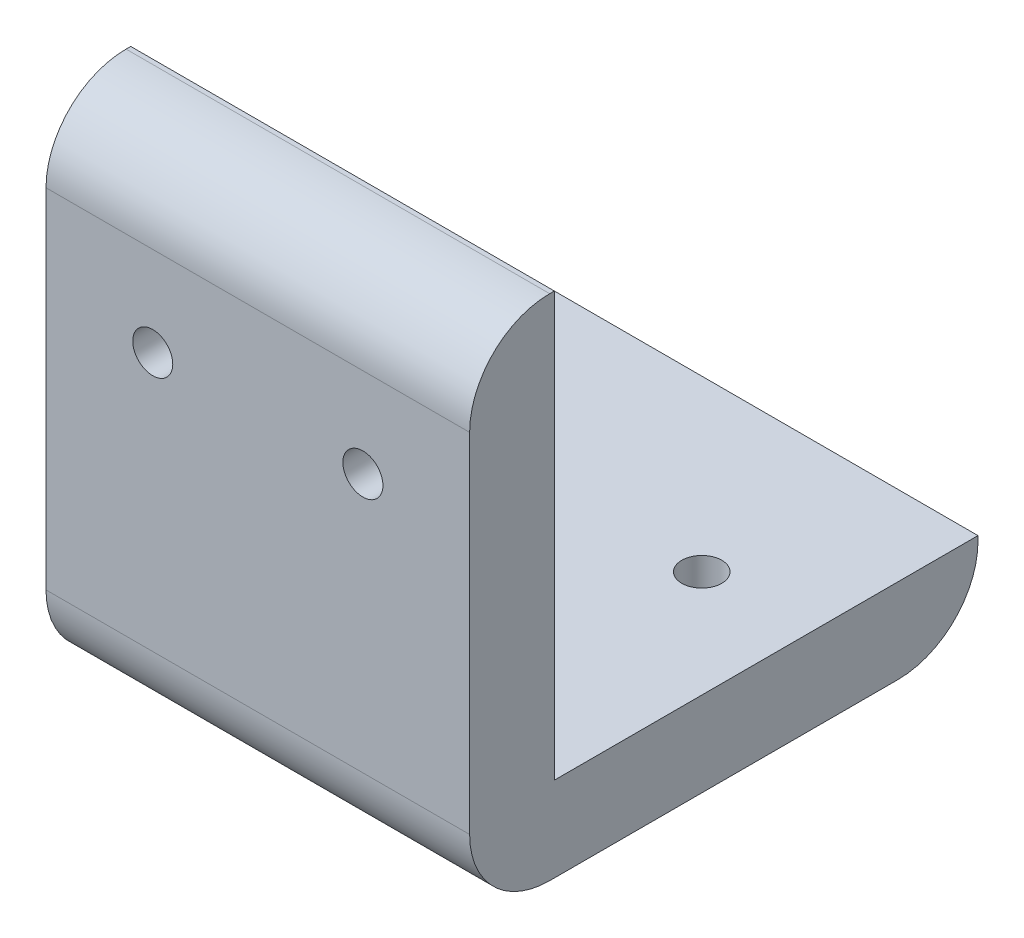
ISO-10303-21;
HEADER;
FILE_DESCRIPTION(('STEP AP214'),'2;1');
FILE_NAME('part.step','',(''),(''),'','','');
FILE_SCHEMA(('AUTOMOTIVE_DESIGN { 1 0 10303 214 1 1 1 1 }'));
ENDSEC;
DATA;
#1=APPLICATION_CONTEXT('core data for automotive mechanical design processes');
#2=APPLICATION_PROTOCOL_DEFINITION('international standard','automotive_design',2000,#1);
#3=PRODUCT_CONTEXT('',#1,'mechanical');
#4=PRODUCT('Part','Part','',(#3));
#5=PRODUCT_RELATED_PRODUCT_CATEGORY('part','',(#4));
#6=PRODUCT_DEFINITION_FORMATION('','',#4);
#7=PRODUCT_DEFINITION_CONTEXT('part definition',#1,'design');
#8=PRODUCT_DEFINITION('design','',#6,#7);
#9=PRODUCT_DEFINITION_SHAPE('','',#8);
#10=(LENGTH_UNIT() NAMED_UNIT(*) SI_UNIT(.MILLI.,.METRE.));
#11=(NAMED_UNIT(*) PLANE_ANGLE_UNIT() SI_UNIT($,.RADIAN.));
#12=(NAMED_UNIT(*) SI_UNIT($,.STERADIAN.) SOLID_ANGLE_UNIT());
#13=UNCERTAINTY_MEASURE_WITH_UNIT(LENGTH_MEASURE(1.E-05),#10,'distance_accuracy_value','');
#14=(GEOMETRIC_REPRESENTATION_CONTEXT(3) GLOBAL_UNCERTAINTY_ASSIGNED_CONTEXT((#13)) GLOBAL_UNIT_ASSIGNED_CONTEXT((#10,
#11,#12)) REPRESENTATION_CONTEXT('',''));
#15=CARTESIAN_POINT('',(0.,0.,0.));
#16=DIRECTION('',(0.,0.,1.));
#17=DIRECTION('',(1.,0.,0.));
#18=AXIS2_PLACEMENT_3D('',#15,#16,#17);
#19=CARTESIAN_POINT('',(31.75,31.75,0.));
#20=DIRECTION('',(0.,-1.,0.));
#21=DIRECTION('',(0.,0.,-1.));
#22=AXIS2_PLACEMENT_3D('',#19,#20,#21);
#23=PLANE('',#22);
#24=DIRECTION('',(0.,0.,1.));
#25=VECTOR('',#24,1.);
#26=CARTESIAN_POINT('',(0.,31.75,0.));
#27=LINE('',#26,#25);
#28=CARTESIAN_POINT('',(0.,31.75,0.));
#29=VERTEX_POINT('',#28);
#30=CARTESIAN_POINT('',(0.,31.75,0.349999999999997));
#31=VERTEX_POINT('',#30);
#32=EDGE_CURVE('E139',#29,#31,#27,.T.);
#33=ORIENTED_EDGE('',*,*,#32,.T.);
#34=DIRECTION('',(-1.,0.,0.));
#35=VECTOR('',#34,1.);
#36=CARTESIAN_POINT('',(31.75,31.75,0.349999999999997));
#37=LINE('',#36,#35);
#38=CARTESIAN_POINT('',(31.75,31.75,0.349999999999997));
#39=VERTEX_POINT('',#38);
#40=EDGE_CURVE('E163',#31,#39,#37,.F.);
#41=ORIENTED_EDGE('',*,*,#40,.T.);
#42=DIRECTION('',(0.,0.,1.));
#43=VECTOR('',#42,1.);
#44=CARTESIAN_POINT('',(31.75,31.75,0.));
#45=LINE('',#44,#43);
#46=CARTESIAN_POINT('',(31.75,31.75,0.));
#47=VERTEX_POINT('',#46);
#48=EDGE_CURVE('E152',#47,#39,#45,.T.);
#49=ORIENTED_EDGE('',*,*,#48,.F.);
#50=DIRECTION('',(-1.,0.,0.));
#51=VECTOR('',#50,1.);
#52=CARTESIAN_POINT('',(31.75,31.75,0.));
#53=LINE('',#52,#51);
#54=EDGE_CURVE('E135',#47,#29,#53,.T.);
#55=ORIENTED_EDGE('',*,*,#54,.T.);
#56=EDGE_LOOP('',(#33,#41,#49,#55));
#57=FACE_BOUND('',#56,.T.);
#58=ADVANCED_FACE('F37',(#57),#23,.F.);
#59=CARTESIAN_POINT('',(31.75,31.75,6.35));
#60=DIRECTION('',(0.,0.,-1.));
#61=DIRECTION('',(0.,1.,0.));
#62=AXIS2_PLACEMENT_3D('',#59,#60,#61);
#63=PLANE('',#62);
#64=CARTESIAN_POINT('',(8.,19.05,6.35));
#65=DIRECTION('',(0.,0.,1.));
#66=DIRECTION('',(1.,0.,0.));
#67=AXIS2_PLACEMENT_3D('',#64,#65,#66);
#68=CIRCLE('',#67,1.5);
#69=CARTESIAN_POINT('',(9.5,19.05,6.35));
#70=VERTEX_POINT('',#69);
#71=EDGE_CURVE('E177',#70,#70,#68,.T.);
#72=ORIENTED_EDGE('',*,*,#71,.F.);
#73=EDGE_LOOP('',(#72));
#74=FACE_BOUND('',#73,.T.);
#75=CARTESIAN_POINT('',(23.75,19.05,6.35));
#76=DIRECTION('',(0.,0.,1.));
#77=DIRECTION('',(1.,0.,0.));
#78=AXIS2_PLACEMENT_3D('',#75,#76,#77);
#79=CIRCLE('',#78,1.5);
#80=CARTESIAN_POINT('',(25.25,19.05,6.35));
#81=VERTEX_POINT('',#80);
#82=EDGE_CURVE('E187',#81,#81,#79,.T.);
#83=ORIENTED_EDGE('',*,*,#82,.F.);
#84=EDGE_LOOP('',(#83));
#85=FACE_BOUND('',#84,.T.);
#86=DIRECTION('',(0.,-1.,0.));
#87=VECTOR('',#86,1.);
#88=CARTESIAN_POINT('',(0.,31.75,6.35));
#89=LINE('',#88,#87);
#90=CARTESIAN_POINT('',(0.,25.75,6.35));
#91=VERTEX_POINT('',#90);
#92=CARTESIAN_POINT('',(0.,-0.350000000000003,6.35));
#93=VERTEX_POINT('',#92);
#94=EDGE_CURVE('E142',#91,#93,#89,.T.);
#95=ORIENTED_EDGE('',*,*,#94,.T.);
#96=DIRECTION('',(-1.,0.,0.));
#97=VECTOR('',#96,1.);
#98=CARTESIAN_POINT('',(31.75,-0.350000000000003,6.35));
#99=LINE('',#98,#97);
#100=CARTESIAN_POINT('',(31.75,-0.350000000000003,6.35));
#101=VERTEX_POINT('',#100);
#102=EDGE_CURVE('E45',#93,#101,#99,.F.);
#103=ORIENTED_EDGE('',*,*,#102,.T.);
#104=DIRECTION('',(0.,-1.,0.));
#105=VECTOR('',#104,1.);
#106=CARTESIAN_POINT('',(31.75,31.75,6.35));
#107=LINE('',#106,#105);
#108=CARTESIAN_POINT('',(31.75,25.75,6.35));
#109=VERTEX_POINT('',#108);
#110=EDGE_CURVE('E269',#109,#101,#107,.T.);
#111=ORIENTED_EDGE('',*,*,#110,.F.);
#112=DIRECTION('',(-1.,0.,0.));
#113=VECTOR('',#112,1.);
#114=CARTESIAN_POINT('',(31.75,25.75,6.35));
#115=LINE('',#114,#113);
#116=EDGE_CURVE('E127',#109,#91,#115,.T.);
#117=ORIENTED_EDGE('',*,*,#116,.T.);
#118=EDGE_LOOP('',(#95,#103,#111,#117));
#119=FACE_BOUND('',#118,.T.);
#120=ADVANCED_FACE('F213',(#74,#85,#119),#63,.F.);
#121=CARTESIAN_POINT('',(31.75,-6.35,6.34999999999999));
#122=DIRECTION('',(0.,1.,0.));
#123=DIRECTION('',(0.,0.,1.));
#124=AXIS2_PLACEMENT_3D('',#121,#122,#123);
#125=PLANE('',#124);
#126=CARTESIAN_POINT('',(8.,-6.35,-19.05));
#127=DIRECTION('',(0.,-1.,0.));
#128=DIRECTION('',(0.,0.,-1.));
#129=AXIS2_PLACEMENT_3D('',#126,#127,#128);
#130=CIRCLE('',#129,1.5);
#131=CARTESIAN_POINT('',(8.,-6.35,-20.55));
#132=VERTEX_POINT('',#131);
#133=EDGE_CURVE('E184',#132,#132,#130,.T.);
#134=ORIENTED_EDGE('',*,*,#133,.F.);
#135=EDGE_LOOP('',(#134));
#136=FACE_BOUND('',#135,.T.);
#137=CARTESIAN_POINT('',(23.75,-6.35,-19.05));
#138=DIRECTION('',(0.,-1.,0.));
#139=DIRECTION('',(0.,0.,-1.));
#140=AXIS2_PLACEMENT_3D('',#137,#138,#139);
#141=CIRCLE('',#140,1.5);
#142=CARTESIAN_POINT('',(23.75,-6.35,-20.55));
#143=VERTEX_POINT('',#142);
#144=EDGE_CURVE('E258',#143,#143,#141,.T.);
#145=ORIENTED_EDGE('',*,*,#144,.F.);
#146=EDGE_LOOP('',(#145));
#147=FACE_BOUND('',#146,.T.);
#148=DIRECTION('',(0.,0.,-1.));
#149=VECTOR('',#148,1.);
#150=CARTESIAN_POINT('',(31.75,-6.35,6.34999999999999));
#151=LINE('',#150,#149);
#152=CARTESIAN_POINT('',(31.75,-6.35,0.349999999999995));
#153=VERTEX_POINT('',#152);
#154=CARTESIAN_POINT('',(31.75,-6.35,-25.75));
#155=VERTEX_POINT('',#154);
#156=EDGE_CURVE('E118',#153,#155,#151,.T.);
#157=ORIENTED_EDGE('',*,*,#156,.F.);
#158=DIRECTION('',(-1.,0.,0.));
#159=VECTOR('',#158,1.);
#160=CARTESIAN_POINT('',(31.75,-6.35,0.349999999999995));
#161=LINE('',#160,#159);
#162=CARTESIAN_POINT('',(0.,-6.35,0.349999999999995));
#163=VERTEX_POINT('',#162);
#164=EDGE_CURVE('E173',#153,#163,#161,.T.);
#165=ORIENTED_EDGE('',*,*,#164,.T.);
#166=DIRECTION('',(0.,0.,-1.));
#167=VECTOR('',#166,1.);
#168=CARTESIAN_POINT('',(0.,-6.35,6.34999999999999));
#169=LINE('',#168,#167);
#170=CARTESIAN_POINT('',(0.,-6.35,-25.75));
#171=VERTEX_POINT('',#170);
#172=EDGE_CURVE('E145',#163,#171,#169,.T.);
#173=ORIENTED_EDGE('',*,*,#172,.T.);
#174=DIRECTION('',(-1.,0.,0.));
#175=VECTOR('',#174,1.);
#176=CARTESIAN_POINT('',(31.75,-6.35,-25.75));
#177=LINE('',#176,#175);
#178=EDGE_CURVE('E170',#171,#155,#177,.F.);
#179=ORIENTED_EDGE('',*,*,#178,.T.);
#180=EDGE_LOOP('',(#157,#165,#173,#179));
#181=FACE_BOUND('',#180,.T.);
#182=ADVANCED_FACE('F193',(#136,#147,#181),#125,.F.);
#183=CARTESIAN_POINT('',(31.75,-6.35,-31.75));
#184=DIRECTION('',(0.,0.,1.));
#185=DIRECTION('',(1.,0.,0.));
#186=AXIS2_PLACEMENT_3D('',#183,#184,#185);
#187=PLANE('',#186);
#188=DIRECTION('',(0.,1.,0.));
#189=VECTOR('',#188,1.);
#190=CARTESIAN_POINT('',(31.75,-6.35,-31.75));
#191=LINE('',#190,#189);
#192=CARTESIAN_POINT('',(31.75,-0.350000000000005,-31.75));
#193=VERTEX_POINT('',#192);
#194=CARTESIAN_POINT('',(31.75,0.,-31.75));
#195=VERTEX_POINT('',#194);
#196=EDGE_CURVE('E107',#193,#195,#191,.T.);
#197=ORIENTED_EDGE('',*,*,#196,.F.);
#198=DIRECTION('',(-1.,0.,0.));
#199=VECTOR('',#198,1.);
#200=CARTESIAN_POINT('',(31.75,-0.350000000000005,-31.75));
#201=LINE('',#200,#199);
#202=CARTESIAN_POINT('',(0.,-0.350000000000005,-31.75));
#203=VERTEX_POINT('',#202);
#204=EDGE_CURVE('E168',#193,#203,#201,.T.);
#205=ORIENTED_EDGE('',*,*,#204,.T.);
#206=DIRECTION('',(0.,1.,0.));
#207=VECTOR('',#206,1.);
#208=CARTESIAN_POINT('',(0.,-6.35,-31.75));
#209=LINE('',#208,#207);
#210=CARTESIAN_POINT('',(0.,0.,-31.75));
#211=VERTEX_POINT('',#210);
#212=EDGE_CURVE('E124',#203,#211,#209,.T.);
#213=ORIENTED_EDGE('',*,*,#212,.T.);
#214=DIRECTION('',(-1.,0.,0.));
#215=VECTOR('',#214,1.);
#216=CARTESIAN_POINT('',(31.75,0.,-31.75));
#217=LINE('',#216,#215);
#218=EDGE_CURVE('E121',#195,#211,#217,.T.);
#219=ORIENTED_EDGE('',*,*,#218,.F.);
#220=EDGE_LOOP('',(#197,#205,#213,#219));
#221=FACE_BOUND('',#220,.T.);
#222=ADVANCED_FACE('F122',(#221),#187,.F.);
#223=CARTESIAN_POINT('',(31.75,0.,-31.75));
#224=DIRECTION('',(0.,-1.,0.));
#225=DIRECTION('',(0.,0.,-1.));
#226=AXIS2_PLACEMENT_3D('',#223,#224,#225);
#227=PLANE('',#226);
#228=CARTESIAN_POINT('',(8.,0.,-19.05));
#229=DIRECTION('',(0.,-1.,0.));
#230=DIRECTION('',(0.,0.,-1.));
#231=AXIS2_PLACEMENT_3D('',#228,#229,#230);
#232=CIRCLE('',#231,1.5);
#233=CARTESIAN_POINT('',(8.,0.,-20.55));
#234=VERTEX_POINT('',#233);
#235=EDGE_CURVE('E183',#234,#234,#232,.T.);
#236=ORIENTED_EDGE('',*,*,#235,.T.);
#237=EDGE_LOOP('',(#236));
#238=FACE_BOUND('',#237,.T.);
#239=CARTESIAN_POINT('',(23.75,0.,-19.05));
#240=DIRECTION('',(0.,-1.,0.));
#241=DIRECTION('',(0.,0.,-1.));
#242=AXIS2_PLACEMENT_3D('',#239,#240,#241);
#243=CIRCLE('',#242,1.5);
#244=CARTESIAN_POINT('',(23.75,0.,-20.55));
#245=VERTEX_POINT('',#244);
#246=EDGE_CURVE('E180',#245,#245,#243,.T.);
#247=ORIENTED_EDGE('',*,*,#246,.T.);
#248=EDGE_LOOP('',(#247));
#249=FACE_BOUND('',#248,.T.);
#250=DIRECTION('',(0.,0.,1.));
#251=VECTOR('',#250,1.);
#252=CARTESIAN_POINT('',(0.,0.,-31.75));
#253=LINE('',#252,#251);
#254=CARTESIAN_POINT('',(0.,0.,0.));
#255=VERTEX_POINT('',#254);
#256=EDGE_CURVE('E148',#211,#255,#253,.T.);
#257=ORIENTED_EDGE('',*,*,#256,.T.);
#258=DIRECTION('',(-1.,0.,0.));
#259=VECTOR('',#258,1.);
#260=CARTESIAN_POINT('',(31.75,0.,0.));
#261=LINE('',#260,#259);
#262=CARTESIAN_POINT('',(31.75,0.,0.));
#263=VERTEX_POINT('',#262);
#264=EDGE_CURVE('E128',#263,#255,#261,.T.);
#265=ORIENTED_EDGE('',*,*,#264,.F.);
#266=DIRECTION('',(0.,0.,1.));
#267=VECTOR('',#266,1.);
#268=CARTESIAN_POINT('',(31.75,0.,-31.75));
#269=LINE('',#268,#267);
#270=EDGE_CURVE('E111',#195,#263,#269,.T.);
#271=ORIENTED_EDGE('',*,*,#270,.F.);
#272=ORIENTED_EDGE('',*,*,#218,.T.);
#273=EDGE_LOOP('',(#257,#265,#271,#272));
#274=FACE_BOUND('',#273,.T.);
#275=ADVANCED_FACE('F130',(#238,#249,#274),#227,.F.);
#276=CARTESIAN_POINT('',(31.75,0.,0.));
#277=DIRECTION('',(0.,0.,1.));
#278=DIRECTION('',(1.,0.,0.));
#279=AXIS2_PLACEMENT_3D('',#276,#277,#278);
#280=PLANE('',#279);
#281=CARTESIAN_POINT('',(8.,19.05,0.));
#282=DIRECTION('',(0.,0.,1.));
#283=DIRECTION('',(1.,0.,0.));
#284=AXIS2_PLACEMENT_3D('',#281,#282,#283);
#285=CIRCLE('',#284,1.5);
#286=CARTESIAN_POINT('',(9.5,19.05,0.));
#287=VERTEX_POINT('',#286);
#288=EDGE_CURVE('E143',#287,#287,#285,.T.);
#289=ORIENTED_EDGE('',*,*,#288,.T.);
#290=EDGE_LOOP('',(#289));
#291=FACE_BOUND('',#290,.T.);
#292=CARTESIAN_POINT('',(23.75,19.05,0.));
#293=DIRECTION('',(0.,0.,1.));
#294=DIRECTION('',(1.,0.,0.));
#295=AXIS2_PLACEMENT_3D('',#292,#293,#294);
#296=CIRCLE('',#295,1.5);
#297=CARTESIAN_POINT('',(25.25,19.05,0.));
#298=VERTEX_POINT('',#297);
#299=EDGE_CURVE('E174',#298,#298,#296,.T.);
#300=ORIENTED_EDGE('',*,*,#299,.T.);
#301=EDGE_LOOP('',(#300));
#302=FACE_BOUND('',#301,.T.);
#303=DIRECTION('',(0.,1.,0.));
#304=VECTOR('',#303,1.);
#305=CARTESIAN_POINT('',(0.,0.,0.));
#306=LINE('',#305,#304);
#307=EDGE_CURVE('E150',#255,#29,#306,.T.);
#308=ORIENTED_EDGE('',*,*,#307,.T.);
#309=ORIENTED_EDGE('',*,*,#54,.F.);
#310=DIRECTION('',(0.,1.,0.));
#311=VECTOR('',#310,1.);
#312=CARTESIAN_POINT('',(31.75,0.,0.));
#313=LINE('',#312,#311);
#314=EDGE_CURVE('E133',#263,#47,#313,.T.);
#315=ORIENTED_EDGE('',*,*,#314,.F.);
#316=ORIENTED_EDGE('',*,*,#264,.T.);
#317=EDGE_LOOP('',(#308,#309,#315,#316));
#318=FACE_BOUND('',#317,.T.);
#319=ADVANCED_FACE('F229',(#291,#302,#318),#280,.F.);
#320=CARTESIAN_POINT('',(31.75,0.,0.));
#321=DIRECTION('',(1.,0.,0.));
#322=DIRECTION('',(0.,0.,-1.));
#323=AXIS2_PLACEMENT_3D('',#320,#321,#322);
#324=PLANE('',#323);
#325=ORIENTED_EDGE('',*,*,#110,.T.);
#326=CARTESIAN_POINT('',(31.75,-0.350000000000005,0.349999999999995));
#327=DIRECTION('',(1.,0.,0.));
#328=DIRECTION('',(0.,0.,-1.));
#329=AXIS2_PLACEMENT_3D('',#326,#327,#328);
#330=CIRCLE('',#329,6.);
#331=EDGE_CURVE('E11',#101,#153,#330,.T.);
#332=ORIENTED_EDGE('',*,*,#331,.T.);
#333=ORIENTED_EDGE('',*,*,#156,.T.);
#334=CARTESIAN_POINT('',(31.75,-0.350000000000005,-25.75));
#335=DIRECTION('',(1.,0.,0.));
#336=DIRECTION('',(0.,0.,-1.));
#337=AXIS2_PLACEMENT_3D('',#334,#335,#336);
#338=CIRCLE('',#337,6.);
#339=EDGE_CURVE('E114',#155,#193,#338,.T.);
#340=ORIENTED_EDGE('',*,*,#339,.T.);
#341=ORIENTED_EDGE('',*,*,#196,.T.);
#342=ORIENTED_EDGE('',*,*,#270,.T.);
#343=ORIENTED_EDGE('',*,*,#314,.T.);
#344=ORIENTED_EDGE('',*,*,#48,.T.);
#345=CARTESIAN_POINT('',(31.75,25.75,0.349999999999997));
#346=DIRECTION('',(1.,0.,0.));
#347=DIRECTION('',(0.,0.,-1.));
#348=AXIS2_PLACEMENT_3D('',#345,#346,#347);
#349=CIRCLE('',#348,6.);
#350=EDGE_CURVE('E166',#39,#109,#349,.T.);
#351=ORIENTED_EDGE('',*,*,#350,.T.);
#352=EDGE_LOOP('',(#325,#332,#333,#340,#341,#342,#343,#344,#351));
#353=FACE_BOUND('',#352,.T.);
#354=ADVANCED_FACE('F109',(#353),#324,.T.);
#355=CARTESIAN_POINT('',(0.,0.,0.));
#356=DIRECTION('',(1.,0.,0.));
#357=DIRECTION('',(0.,0.,-1.));
#358=AXIS2_PLACEMENT_3D('',#355,#356,#357);
#359=PLANE('',#358);
#360=ORIENTED_EDGE('',*,*,#172,.F.);
#361=CARTESIAN_POINT('',(0.,-0.350000000000005,0.349999999999995));
#362=DIRECTION('',(1.,0.,0.));
#363=DIRECTION('',(0.,0.,-1.));
#364=AXIS2_PLACEMENT_3D('',#361,#362,#363);
#365=CIRCLE('',#364,6.);
#366=EDGE_CURVE('E59',#163,#93,#365,.F.);
#367=ORIENTED_EDGE('',*,*,#366,.T.);
#368=ORIENTED_EDGE('',*,*,#94,.F.);
#369=CARTESIAN_POINT('',(0.,25.75,0.349999999999997));
#370=DIRECTION('',(1.,0.,0.));
#371=DIRECTION('',(0.,0.,-1.));
#372=AXIS2_PLACEMENT_3D('',#369,#370,#371);
#373=CIRCLE('',#372,6.);
#374=EDGE_CURVE('E161',#91,#31,#373,.F.);
#375=ORIENTED_EDGE('',*,*,#374,.T.);
#376=ORIENTED_EDGE('',*,*,#32,.F.);
#377=ORIENTED_EDGE('',*,*,#307,.F.);
#378=ORIENTED_EDGE('',*,*,#256,.F.);
#379=ORIENTED_EDGE('',*,*,#212,.F.);
#380=CARTESIAN_POINT('',(0.,-0.350000000000005,-25.75));
#381=DIRECTION('',(1.,0.,0.));
#382=DIRECTION('',(0.,0.,-1.));
#383=AXIS2_PLACEMENT_3D('',#380,#381,#382);
#384=CIRCLE('',#383,6.);
#385=EDGE_CURVE('E158',#203,#171,#384,.F.);
#386=ORIENTED_EDGE('',*,*,#385,.T.);
#387=EDGE_LOOP('',(#360,#367,#368,#375,#376,#377,#378,#379,#386));
#388=FACE_BOUND('',#387,.T.);
#389=ADVANCED_FACE('F196',(#388),#359,.F.);
#390=CARTESIAN_POINT('',(31.75,25.75,0.349999999999997));
#391=DIRECTION('',(-1.,0.,0.));
#392=DIRECTION('',(0.,0.,1.));
#393=AXIS2_PLACEMENT_3D('',#390,#391,#392);
#394=CYLINDRICAL_SURFACE('',#393,6.);
#395=ORIENTED_EDGE('',*,*,#350,.F.);
#396=ORIENTED_EDGE('',*,*,#40,.F.);
#397=ORIENTED_EDGE('',*,*,#374,.F.);
#398=ORIENTED_EDGE('',*,*,#116,.F.);
#399=EDGE_LOOP('',(#395,#396,#397,#398));
#400=FACE_BOUND('',#399,.T.);
#401=ADVANCED_FACE('F202',(#400),#394,.T.);
#402=CARTESIAN_POINT('',(31.75,-0.350000000000005,-25.75));
#403=DIRECTION('',(-1.,0.,0.));
#404=DIRECTION('',(0.,0.,1.));
#405=AXIS2_PLACEMENT_3D('',#402,#403,#404);
#406=CYLINDRICAL_SURFACE('',#405,6.);
#407=ORIENTED_EDGE('',*,*,#339,.F.);
#408=ORIENTED_EDGE('',*,*,#178,.F.);
#409=ORIENTED_EDGE('',*,*,#385,.F.);
#410=ORIENTED_EDGE('',*,*,#204,.F.);
#411=EDGE_LOOP('',(#407,#408,#409,#410));
#412=FACE_BOUND('',#411,.T.);
#413=ADVANCED_FACE('F199',(#412),#406,.T.);
#414=CARTESIAN_POINT('',(23.75,19.05,-31.75));
#415=DIRECTION('',(0.,0.,1.));
#416=DIRECTION('',(1.,0.,0.));
#417=AXIS2_PLACEMENT_3D('',#414,#415,#416);
#418=CYLINDRICAL_SURFACE('',#417,1.5);
#419=ORIENTED_EDGE('',*,*,#82,.T.);
#420=EDGE_LOOP('',(#419));
#421=FACE_BOUND('',#420,.T.);
#422=ORIENTED_EDGE('',*,*,#299,.F.);
#423=EDGE_LOOP('',(#422));
#424=FACE_BOUND('',#423,.T.);
#425=ADVANCED_FACE('F201',(#421,#424),#418,.F.);
#426=CARTESIAN_POINT('',(8.,19.05,-31.75));
#427=DIRECTION('',(0.,0.,1.));
#428=DIRECTION('',(1.,0.,0.));
#429=AXIS2_PLACEMENT_3D('',#426,#427,#428);
#430=CYLINDRICAL_SURFACE('',#429,1.5);
#431=ORIENTED_EDGE('',*,*,#71,.T.);
#432=EDGE_LOOP('',(#431));
#433=FACE_BOUND('',#432,.T.);
#434=ORIENTED_EDGE('',*,*,#288,.F.);
#435=EDGE_LOOP('',(#434));
#436=FACE_BOUND('',#435,.T.);
#437=ADVANCED_FACE('F207',(#433,#436),#430,.F.);
#438=CARTESIAN_POINT('',(23.75,31.75,-19.05));
#439=DIRECTION('',(0.,-1.,0.));
#440=DIRECTION('',(0.,0.,-1.));
#441=AXIS2_PLACEMENT_3D('',#438,#439,#440);
#442=CYLINDRICAL_SURFACE('',#441,1.5);
#443=ORIENTED_EDGE('',*,*,#144,.T.);
#444=EDGE_LOOP('',(#443));
#445=FACE_BOUND('',#444,.T.);
#446=ORIENTED_EDGE('',*,*,#246,.F.);
#447=EDGE_LOOP('',(#446));
#448=FACE_BOUND('',#447,.T.);
#449=ADVANCED_FACE('F240',(#445,#448),#442,.F.);
#450=CARTESIAN_POINT('',(8.,31.75,-19.05));
#451=DIRECTION('',(0.,-1.,0.));
#452=DIRECTION('',(0.,0.,-1.));
#453=AXIS2_PLACEMENT_3D('',#450,#451,#452);
#454=CYLINDRICAL_SURFACE('',#453,1.5);
#455=ORIENTED_EDGE('',*,*,#133,.T.);
#456=EDGE_LOOP('',(#455));
#457=FACE_BOUND('',#456,.T.);
#458=ORIENTED_EDGE('',*,*,#235,.F.);
#459=EDGE_LOOP('',(#458));
#460=FACE_BOUND('',#459,.T.);
#461=ADVANCED_FACE('F244',(#457,#460),#454,.F.);
#462=CARTESIAN_POINT('',(31.75,-0.350000000000005,0.349999999999995));
#463=DIRECTION('',(-1.,0.,0.));
#464=DIRECTION('',(0.,0.,1.));
#465=AXIS2_PLACEMENT_3D('',#462,#463,#464);
#466=CYLINDRICAL_SURFACE('',#465,6.);
#467=ORIENTED_EDGE('',*,*,#331,.F.);
#468=ORIENTED_EDGE('',*,*,#102,.F.);
#469=ORIENTED_EDGE('',*,*,#366,.F.);
#470=ORIENTED_EDGE('',*,*,#164,.F.);
#471=EDGE_LOOP('',(#467,#468,#469,#470));
#472=FACE_BOUND('',#471,.T.);
#473=ADVANCED_FACE('F39',(#472),#466,.T.);
#474=CLOSED_SHELL('',(#58,#120,#182,#222,#275,#319,#354,#389,#401,#413,#425,#437,#449,#461,#473));
#475=MANIFOLD_SOLID_BREP('B2',#474);
#476=ADVANCED_BREP_SHAPE_REPRESENTATION('',(#18,#475),#14);
#477=SHAPE_DEFINITION_REPRESENTATION(#9,#476);
ENDSEC;
END-ISO-10303-21;
